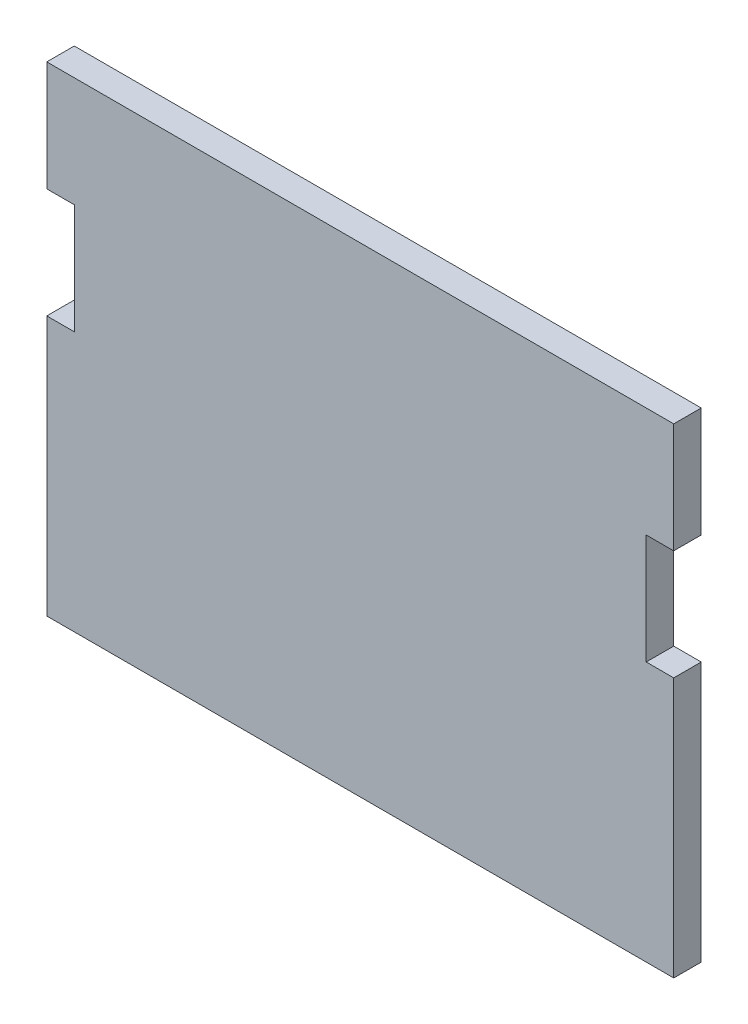
ISO-10303-21;
HEADER;
FILE_DESCRIPTION(('STEP AP214'),'2;1');
FILE_NAME('part.step','',(''),(''),'','','');
FILE_SCHEMA(('AUTOMOTIVE_DESIGN { 1 0 10303 214 1 1 1 1 }'));
ENDSEC;
DATA;
#1=APPLICATION_CONTEXT('core data for automotive mechanical design processes');
#2=APPLICATION_PROTOCOL_DEFINITION('international standard','automotive_design',2000,#1);
#3=PRODUCT_CONTEXT('',#1,'mechanical');
#4=PRODUCT('Part','Part','',(#3));
#5=PRODUCT_RELATED_PRODUCT_CATEGORY('part','',(#4));
#6=PRODUCT_DEFINITION_FORMATION('','',#4);
#7=PRODUCT_DEFINITION_CONTEXT('part definition',#1,'design');
#8=PRODUCT_DEFINITION('design','',#6,#7);
#9=PRODUCT_DEFINITION_SHAPE('','',#8);
#10=(LENGTH_UNIT() NAMED_UNIT(*) SI_UNIT(.MILLI.,.METRE.));
#11=(NAMED_UNIT(*) PLANE_ANGLE_UNIT() SI_UNIT($,.RADIAN.));
#12=(NAMED_UNIT(*) SI_UNIT($,.STERADIAN.) SOLID_ANGLE_UNIT());
#13=UNCERTAINTY_MEASURE_WITH_UNIT(LENGTH_MEASURE(1.E-05),#10,'distance_accuracy_value','');
#14=(GEOMETRIC_REPRESENTATION_CONTEXT(3) GLOBAL_UNCERTAINTY_ASSIGNED_CONTEXT((#13)) GLOBAL_UNIT_ASSIGNED_CONTEXT((#10,
#11,#12)) REPRESENTATION_CONTEXT('',''));
#15=CARTESIAN_POINT('',(0.,0.,0.));
#16=DIRECTION('',(0.,0.,1.));
#17=DIRECTION('',(1.,0.,0.));
#18=AXIS2_PLACEMENT_3D('',#15,#16,#17);
#19=CARTESIAN_POINT('',(72.39,57.15,0.));
#20=DIRECTION('',(0.,0.,-1.));
#21=DIRECTION('',(-1.,0.,0.));
#22=AXIS2_PLACEMENT_3D('',#19,#20,#21);
#23=PLANE('',#22);
#24=DIRECTION('',(-1.,0.,0.));
#25=VECTOR('',#24,1.);
#26=CARTESIAN_POINT('',(72.39,-53.6729623036489,0.));
#27=LINE('',#26,#25);
#28=CARTESIAN_POINT('',(72.39,-53.6729623036489,0.));
#29=VERTEX_POINT('',#28);
#30=CARTESIAN_POINT('',(-72.39,-53.6729623036489,0.));
#31=VERTEX_POINT('',#30);
#32=EDGE_CURVE('E123',#29,#31,#27,.T.);
#33=ORIENTED_EDGE('',*,*,#32,.T.);
#34=DIRECTION('',(0.,-1.,0.));
#35=VECTOR('',#34,1.);
#36=CARTESIAN_POINT('',(-72.39,-57.15,0.));
#37=LINE('',#36,#35);
#38=CARTESIAN_POINT('',(-72.39,6.35000000000001,0.));
#39=VERTEX_POINT('',#38);
#40=EDGE_CURVE('E145',#39,#31,#37,.T.);
#41=ORIENTED_EDGE('',*,*,#40,.F.);
#42=DIRECTION('',(1.,0.,0.));
#43=VECTOR('',#42,1.);
#44=CARTESIAN_POINT('',(-72.39,6.35000000000001,0.));
#45=LINE('',#44,#43);
#46=CARTESIAN_POINT('',(-66.04,6.35000000000001,0.));
#47=VERTEX_POINT('',#46);
#48=EDGE_CURVE('E175',#39,#47,#45,.T.);
#49=ORIENTED_EDGE('',*,*,#48,.T.);
#50=DIRECTION('',(0.,-1.,0.));
#51=VECTOR('',#50,1.);
#52=CARTESIAN_POINT('',(-66.04,6.35000000000001,0.));
#53=LINE('',#52,#51);
#54=CARTESIAN_POINT('',(-66.04,31.75,0.));
#55=VERTEX_POINT('',#54);
#56=EDGE_CURVE('E185',#55,#47,#53,.T.);
#57=ORIENTED_EDGE('',*,*,#56,.F.);
#58=DIRECTION('',(1.,0.,0.));
#59=VECTOR('',#58,1.);
#60=CARTESIAN_POINT('',(-72.39,31.75,0.));
#61=LINE('',#60,#59);
#62=CARTESIAN_POINT('',(-72.39,31.75,0.));
#63=VERTEX_POINT('',#62);
#64=EDGE_CURVE('E173',#63,#55,#61,.T.);
#65=ORIENTED_EDGE('',*,*,#64,.F.);
#66=CARTESIAN_POINT('',(-72.39,57.15,0.));
#67=VERTEX_POINT('',#66);
#68=EDGE_CURVE('E152',#67,#63,#37,.T.);
#69=ORIENTED_EDGE('',*,*,#68,.F.);
#70=DIRECTION('',(-1.,0.,0.));
#71=VECTOR('',#70,1.);
#72=CARTESIAN_POINT('',(-72.39,57.15,0.));
#73=LINE('',#72,#71);
#74=CARTESIAN_POINT('',(72.39,57.15,0.));
#75=VERTEX_POINT('',#74);
#76=EDGE_CURVE('E142',#75,#67,#73,.T.);
#77=ORIENTED_EDGE('',*,*,#76,.F.);
#78=DIRECTION('',(0.,1.,0.));
#79=VECTOR('',#78,1.);
#80=CARTESIAN_POINT('',(72.39,-57.15,0.));
#81=LINE('',#80,#79);
#82=CARTESIAN_POINT('',(72.39,31.75,0.));
#83=VERTEX_POINT('',#82);
#84=EDGE_CURVE('E143',#83,#75,#81,.T.);
#85=ORIENTED_EDGE('',*,*,#84,.F.);
#86=DIRECTION('',(1.,0.,0.));
#87=VECTOR('',#86,1.);
#88=CARTESIAN_POINT('',(66.04,31.75,0.));
#89=LINE('',#88,#87);
#90=CARTESIAN_POINT('',(66.04,31.75,0.));
#91=VERTEX_POINT('',#90);
#92=EDGE_CURVE('E198',#91,#83,#89,.T.);
#93=ORIENTED_EDGE('',*,*,#92,.F.);
#94=DIRECTION('',(0.,-1.,0.));
#95=VECTOR('',#94,1.);
#96=CARTESIAN_POINT('',(66.04,6.35000000000001,0.));
#97=LINE('',#96,#95);
#98=CARTESIAN_POINT('',(66.04,6.35000000000001,0.));
#99=VERTEX_POINT('',#98);
#100=EDGE_CURVE('E212',#91,#99,#97,.T.);
#101=ORIENTED_EDGE('',*,*,#100,.T.);
#102=DIRECTION('',(1.,0.,0.));
#103=VECTOR('',#102,1.);
#104=CARTESIAN_POINT('',(66.04,6.35000000000001,0.));
#105=LINE('',#104,#103);
#106=CARTESIAN_POINT('',(72.39,6.35000000000001,0.));
#107=VERTEX_POINT('',#106);
#108=EDGE_CURVE('E141',#99,#107,#105,.T.);
#109=ORIENTED_EDGE('',*,*,#108,.T.);
#110=EDGE_CURVE('E136',#29,#107,#81,.T.);
#111=ORIENTED_EDGE('',*,*,#110,.F.);
#112=EDGE_LOOP('',(#33,#41,#49,#57,#65,#69,#77,#85,#93,#101,#109,#111));
#113=FACE_BOUND('',#112,.T.);
#114=ADVANCED_FACE('F35',(#113),#23,.T.);
#115=CARTESIAN_POINT('',(72.39,-57.15,6.35));
#116=DIRECTION('',(-1.,0.,0.));
#117=DIRECTION('',(0.,0.,1.));
#118=AXIS2_PLACEMENT_3D('',#115,#116,#117);
#119=PLANE('',#118);
#120=DIRECTION('',(0.,0.,-1.));
#121=VECTOR('',#120,1.);
#122=CARTESIAN_POINT('',(72.39,31.75,6.34999999999998));
#123=LINE('',#122,#121);
#124=CARTESIAN_POINT('',(72.39,31.75,6.34999999999998));
#125=VERTEX_POINT('',#124);
#126=EDGE_CURVE('E207',#125,#83,#123,.T.);
#127=ORIENTED_EDGE('',*,*,#126,.T.);
#128=ORIENTED_EDGE('',*,*,#84,.T.);
#129=DIRECTION('',(0.,0.,-1.));
#130=VECTOR('',#129,1.);
#131=CARTESIAN_POINT('',(72.39,57.15,6.35));
#132=LINE('',#131,#130);
#133=CARTESIAN_POINT('',(72.39,57.15,6.35));
#134=VERTEX_POINT('',#133);
#135=EDGE_CURVE('E11',#134,#75,#132,.T.);
#136=ORIENTED_EDGE('',*,*,#135,.F.);
#137=DIRECTION('',(0.,1.,0.));
#138=VECTOR('',#137,1.);
#139=CARTESIAN_POINT('',(72.39,-57.15,6.35));
#140=LINE('',#139,#138);
#141=EDGE_CURVE('E154',#125,#134,#140,.T.);
#142=ORIENTED_EDGE('',*,*,#141,.F.);
#143=EDGE_LOOP('',(#127,#128,#136,#142));
#144=FACE_BOUND('',#143,.T.);
#145=ADVANCED_FACE('F37',(#144),#119,.F.);
#146=CARTESIAN_POINT('',(72.39,-53.6729623036489,6.35));
#147=VERTEX_POINT('',#146);
#148=CARTESIAN_POINT('',(72.39,6.35000000000001,6.35));
#149=VERTEX_POINT('',#148);
#150=EDGE_CURVE('E57',#147,#149,#140,.T.);
#151=ORIENTED_EDGE('',*,*,#150,.F.);
#152=DIRECTION('',(0.,0.,1.));
#153=VECTOR('',#152,1.);
#154=CARTESIAN_POINT('',(72.39,-53.6729623036489,0.));
#155=LINE('',#154,#153);
#156=EDGE_CURVE('E50',#29,#147,#155,.T.);
#157=ORIENTED_EDGE('',*,*,#156,.F.);
#158=ORIENTED_EDGE('',*,*,#110,.T.);
#159=DIRECTION('',(0.,0.,1.));
#160=VECTOR('',#159,1.);
#161=CARTESIAN_POINT('',(72.39,6.35000000000001,6.34999999999997));
#162=LINE('',#161,#160);
#163=EDGE_CURVE('E204',#107,#149,#162,.T.);
#164=ORIENTED_EDGE('',*,*,#163,.T.);
#165=EDGE_LOOP('',(#151,#157,#158,#164));
#166=FACE_BOUND('',#165,.T.);
#167=ADVANCED_FACE('F134',(#166),#119,.F.);
#168=CARTESIAN_POINT('',(-72.39,-57.15,6.35));
#169=DIRECTION('',(1.,0.,0.));
#170=DIRECTION('',(0.,0.,-1.));
#171=AXIS2_PLACEMENT_3D('',#168,#169,#170);
#172=PLANE('',#171);
#173=DIRECTION('',(0.,0.,-1.));
#174=VECTOR('',#173,1.);
#175=CARTESIAN_POINT('',(-72.39,31.75,6.34999999999999));
#176=LINE('',#175,#174);
#177=CARTESIAN_POINT('',(-72.39,31.75,6.34999999999999));
#178=VERTEX_POINT('',#177);
#179=EDGE_CURVE('E184',#178,#63,#176,.T.);
#180=ORIENTED_EDGE('',*,*,#179,.F.);
#181=DIRECTION('',(0.,-1.,0.));
#182=VECTOR('',#181,1.);
#183=CARTESIAN_POINT('',(-72.39,-57.15,6.35));
#184=LINE('',#183,#182);
#185=CARTESIAN_POINT('',(-72.39,57.15,6.35));
#186=VERTEX_POINT('',#185);
#187=EDGE_CURVE('E149',#186,#178,#184,.T.);
#188=ORIENTED_EDGE('',*,*,#187,.F.);
#189=DIRECTION('',(0.,0.,-1.));
#190=VECTOR('',#189,1.);
#191=CARTESIAN_POINT('',(-72.39,57.15,6.35));
#192=LINE('',#191,#190);
#193=EDGE_CURVE('E43',#186,#67,#192,.T.);
#194=ORIENTED_EDGE('',*,*,#193,.T.);
#195=ORIENTED_EDGE('',*,*,#68,.T.);
#196=EDGE_LOOP('',(#180,#188,#194,#195));
#197=FACE_BOUND('',#196,.T.);
#198=ADVANCED_FACE('F240',(#197),#172,.F.);
#199=ORIENTED_EDGE('',*,*,#40,.T.);
#200=DIRECTION('',(0.,0.,1.));
#201=VECTOR('',#200,1.);
#202=CARTESIAN_POINT('',(-72.39,-53.6729623036489,0.));
#203=LINE('',#202,#201);
#204=CARTESIAN_POINT('',(-72.39,-53.6729623036489,6.35));
#205=VERTEX_POINT('',#204);
#206=EDGE_CURVE('E126',#31,#205,#203,.T.);
#207=ORIENTED_EDGE('',*,*,#206,.T.);
#208=CARTESIAN_POINT('',(-72.39,6.35000000000001,6.35));
#209=VERTEX_POINT('',#208);
#210=EDGE_CURVE('E161',#209,#205,#184,.T.);
#211=ORIENTED_EDGE('',*,*,#210,.F.);
#212=DIRECTION('',(0.,0.,1.));
#213=VECTOR('',#212,1.);
#214=CARTESIAN_POINT('',(-72.39,6.35000000000001,6.35));
#215=LINE('',#214,#213);
#216=EDGE_CURVE('E181',#39,#209,#215,.T.);
#217=ORIENTED_EDGE('',*,*,#216,.F.);
#218=EDGE_LOOP('',(#199,#207,#211,#217));
#219=FACE_BOUND('',#218,.T.);
#220=ADVANCED_FACE('F217',(#219),#172,.F.);
#221=CARTESIAN_POINT('',(72.39,57.15,6.35));
#222=DIRECTION('',(0.,0.,-1.));
#223=DIRECTION('',(-1.,0.,0.));
#224=AXIS2_PLACEMENT_3D('',#221,#222,#223);
#225=PLANE('',#224);
#226=ORIENTED_EDGE('',*,*,#210,.T.);
#227=DIRECTION('',(-1.,0.,0.));
#228=VECTOR('',#227,1.);
#229=CARTESIAN_POINT('',(72.39,-53.6729623036489,6.35));
#230=LINE('',#229,#228);
#231=EDGE_CURVE('E131',#147,#205,#230,.T.);
#232=ORIENTED_EDGE('',*,*,#231,.F.);
#233=ORIENTED_EDGE('',*,*,#150,.T.);
#234=DIRECTION('',(1.,0.,0.));
#235=VECTOR('',#234,1.);
#236=CARTESIAN_POINT('',(66.04,6.35000000000001,6.34999999999997));
#237=LINE('',#236,#235);
#238=CARTESIAN_POINT('',(66.04,6.35000000000001,6.34999999999997));
#239=VERTEX_POINT('',#238);
#240=EDGE_CURVE('E201',#239,#149,#237,.T.);
#241=ORIENTED_EDGE('',*,*,#240,.F.);
#242=DIRECTION('',(0.,1.,0.));
#243=VECTOR('',#242,1.);
#244=CARTESIAN_POINT('',(66.04,57.15,6.35));
#245=LINE('',#244,#243);
#246=CARTESIAN_POINT('',(66.04,31.75,6.34999999999998));
#247=VERTEX_POINT('',#246);
#248=EDGE_CURVE('E190',#239,#247,#245,.T.);
#249=ORIENTED_EDGE('',*,*,#248,.T.);
#250=DIRECTION('',(1.,0.,0.));
#251=VECTOR('',#250,1.);
#252=CARTESIAN_POINT('',(66.04,31.75,6.34999999999998));
#253=LINE('',#252,#251);
#254=EDGE_CURVE('E195',#247,#125,#253,.T.);
#255=ORIENTED_EDGE('',*,*,#254,.T.);
#256=ORIENTED_EDGE('',*,*,#141,.T.);
#257=DIRECTION('',(-1.,0.,0.));
#258=VECTOR('',#257,1.);
#259=CARTESIAN_POINT('',(-72.39,57.15,6.35));
#260=LINE('',#259,#258);
#261=EDGE_CURVE('E164',#134,#186,#260,.T.);
#262=ORIENTED_EDGE('',*,*,#261,.T.);
#263=ORIENTED_EDGE('',*,*,#187,.T.);
#264=DIRECTION('',(1.,0.,0.));
#265=VECTOR('',#264,1.);
#266=CARTESIAN_POINT('',(-72.39,31.75,6.34999999999999));
#267=LINE('',#266,#265);
#268=CARTESIAN_POINT('',(-66.04,31.75,6.34999999999999));
#269=VERTEX_POINT('',#268);
#270=EDGE_CURVE('E171',#178,#269,#267,.T.);
#271=ORIENTED_EDGE('',*,*,#270,.T.);
#272=DIRECTION('',(0.,1.,0.));
#273=VECTOR('',#272,1.);
#274=CARTESIAN_POINT('',(-66.04,57.15,6.35));
#275=LINE('',#274,#273);
#276=CARTESIAN_POINT('',(-66.04,6.35000000000001,6.35));
#277=VERTEX_POINT('',#276);
#278=EDGE_CURVE('E147',#277,#269,#275,.T.);
#279=ORIENTED_EDGE('',*,*,#278,.F.);
#280=DIRECTION('',(1.,0.,0.));
#281=VECTOR('',#280,1.);
#282=CARTESIAN_POINT('',(-72.39,6.35000000000001,6.35));
#283=LINE('',#282,#281);
#284=EDGE_CURVE('E178',#209,#277,#283,.T.);
#285=ORIENTED_EDGE('',*,*,#284,.F.);
#286=EDGE_LOOP('',(#226,#232,#233,#241,#249,#255,#256,#262,#263,#271,#279,#285));
#287=FACE_BOUND('',#286,.T.);
#288=ADVANCED_FACE('F231',(#287),#225,.F.);
#289=CARTESIAN_POINT('',(-72.39,57.15,6.35));
#290=DIRECTION('',(0.,-1.,0.));
#291=DIRECTION('',(0.,0.,-1.));
#292=AXIS2_PLACEMENT_3D('',#289,#290,#291);
#293=PLANE('',#292);
#294=ORIENTED_EDGE('',*,*,#76,.T.);
#295=ORIENTED_EDGE('',*,*,#193,.F.);
#296=ORIENTED_EDGE('',*,*,#261,.F.);
#297=ORIENTED_EDGE('',*,*,#135,.T.);
#298=EDGE_LOOP('',(#294,#295,#296,#297));
#299=FACE_BOUND('',#298,.T.);
#300=ADVANCED_FACE('F233',(#299),#293,.F.);
#301=CARTESIAN_POINT('',(-66.04,57.15,6.34999999999999));
#302=DIRECTION('',(-1.,0.,0.));
#303=DIRECTION('',(0.,-1.,0.));
#304=AXIS2_PLACEMENT_3D('',#301,#302,#303);
#305=PLANE('',#304);
#306=ORIENTED_EDGE('',*,*,#278,.T.);
#307=DIRECTION('',(0.,0.,-1.));
#308=VECTOR('',#307,1.);
#309=CARTESIAN_POINT('',(-66.04,31.75,6.34999999999999));
#310=LINE('',#309,#308);
#311=EDGE_CURVE('E187',#269,#55,#310,.T.);
#312=ORIENTED_EDGE('',*,*,#311,.T.);
#313=ORIENTED_EDGE('',*,*,#56,.T.);
#314=DIRECTION('',(0.,0.,1.));
#315=VECTOR('',#314,1.);
#316=CARTESIAN_POINT('',(-66.04,6.35000000000001,6.35));
#317=LINE('',#316,#315);
#318=EDGE_CURVE('E182',#47,#277,#317,.T.);
#319=ORIENTED_EDGE('',*,*,#318,.T.);
#320=EDGE_LOOP('',(#306,#312,#313,#319));
#321=FACE_BOUND('',#320,.T.);
#322=ADVANCED_FACE('F226',(#321),#305,.T.);
#323=CARTESIAN_POINT('',(-72.39,31.75,6.34999999999999));
#324=DIRECTION('',(0.,-1.,0.));
#325=DIRECTION('',(0.,0.,1.));
#326=AXIS2_PLACEMENT_3D('',#323,#324,#325);
#327=PLANE('',#326);
#328=ORIENTED_EDGE('',*,*,#311,.F.);
#329=ORIENTED_EDGE('',*,*,#270,.F.);
#330=ORIENTED_EDGE('',*,*,#179,.T.);
#331=ORIENTED_EDGE('',*,*,#64,.T.);
#332=EDGE_LOOP('',(#328,#329,#330,#331));
#333=FACE_BOUND('',#332,.T.);
#334=ADVANCED_FACE('F229',(#333),#327,.T.);
#335=CARTESIAN_POINT('',(-72.39,6.35000000000001,6.35));
#336=DIRECTION('',(0.,1.,0.));
#337=DIRECTION('',(0.,0.,-1.));
#338=AXIS2_PLACEMENT_3D('',#335,#336,#337);
#339=PLANE('',#338);
#340=ORIENTED_EDGE('',*,*,#318,.F.);
#341=ORIENTED_EDGE('',*,*,#48,.F.);
#342=ORIENTED_EDGE('',*,*,#216,.T.);
#343=ORIENTED_EDGE('',*,*,#284,.T.);
#344=EDGE_LOOP('',(#340,#341,#342,#343));
#345=FACE_BOUND('',#344,.T.);
#346=ADVANCED_FACE('F223',(#345),#339,.T.);
#347=CARTESIAN_POINT('',(66.04,57.15,6.34999999999999));
#348=DIRECTION('',(-1.,0.,0.));
#349=DIRECTION('',(0.,-1.,0.));
#350=AXIS2_PLACEMENT_3D('',#347,#348,#349);
#351=PLANE('',#350);
#352=DIRECTION('',(0.,0.,1.));
#353=VECTOR('',#352,1.);
#354=CARTESIAN_POINT('',(66.04,6.35000000000001,6.34999999999997));
#355=LINE('',#354,#353);
#356=EDGE_CURVE('E203',#99,#239,#355,.T.);
#357=ORIENTED_EDGE('',*,*,#356,.F.);
#358=ORIENTED_EDGE('',*,*,#100,.F.);
#359=DIRECTION('',(0.,0.,-1.));
#360=VECTOR('',#359,1.);
#361=CARTESIAN_POINT('',(66.04,31.75,6.34999999999998));
#362=LINE('',#361,#360);
#363=EDGE_CURVE('E206',#247,#91,#362,.T.);
#364=ORIENTED_EDGE('',*,*,#363,.F.);
#365=ORIENTED_EDGE('',*,*,#248,.F.);
#366=EDGE_LOOP('',(#357,#358,#364,#365));
#367=FACE_BOUND('',#366,.T.);
#368=ADVANCED_FACE('F264',(#367),#351,.F.);
#369=CARTESIAN_POINT('',(66.04,31.75,6.34999999999998));
#370=DIRECTION('',(0.,-1.,0.));
#371=DIRECTION('',(0.,0.,1.));
#372=AXIS2_PLACEMENT_3D('',#369,#370,#371);
#373=PLANE('',#372);
#374=ORIENTED_EDGE('',*,*,#126,.F.);
#375=ORIENTED_EDGE('',*,*,#254,.F.);
#376=ORIENTED_EDGE('',*,*,#363,.T.);
#377=ORIENTED_EDGE('',*,*,#92,.T.);
#378=EDGE_LOOP('',(#374,#375,#376,#377));
#379=FACE_BOUND('',#378,.T.);
#380=ADVANCED_FACE('F260',(#379),#373,.T.);
#381=CARTESIAN_POINT('',(66.04,6.35000000000001,6.34999999999997));
#382=DIRECTION('',(0.,1.,0.));
#383=DIRECTION('',(0.,0.,-1.));
#384=AXIS2_PLACEMENT_3D('',#381,#382,#383);
#385=PLANE('',#384);
#386=ORIENTED_EDGE('',*,*,#163,.F.);
#387=ORIENTED_EDGE('',*,*,#108,.F.);
#388=ORIENTED_EDGE('',*,*,#356,.T.);
#389=ORIENTED_EDGE('',*,*,#240,.T.);
#390=EDGE_LOOP('',(#386,#387,#388,#389));
#391=FACE_BOUND('',#390,.T.);
#392=ADVANCED_FACE('F267',(#391),#385,.T.);
#393=CARTESIAN_POINT('',(72.39,-53.6729623036489,0.));
#394=DIRECTION('',(0.,1.,0.));
#395=DIRECTION('',(0.,0.,1.));
#396=AXIS2_PLACEMENT_3D('',#393,#394,#395);
#397=PLANE('',#396);
#398=ORIENTED_EDGE('',*,*,#231,.T.);
#399=ORIENTED_EDGE('',*,*,#206,.F.);
#400=ORIENTED_EDGE('',*,*,#32,.F.);
#401=ORIENTED_EDGE('',*,*,#156,.T.);
#402=EDGE_LOOP('',(#398,#399,#400,#401));
#403=FACE_BOUND('',#402,.T.);
#404=ADVANCED_FACE('F124',(#403),#397,.F.);
#405=CLOSED_SHELL('',(#114,#145,#167,#198,#220,#288,#300,#322,#334,#346,#368,#380,#392,#404));
#406=MANIFOLD_SOLID_BREP('B2',#405);
#407=ADVANCED_BREP_SHAPE_REPRESENTATION('',(#18,#406),#14);
#408=SHAPE_DEFINITION_REPRESENTATION(#9,#407);
ENDSEC;
END-ISO-10303-21;
